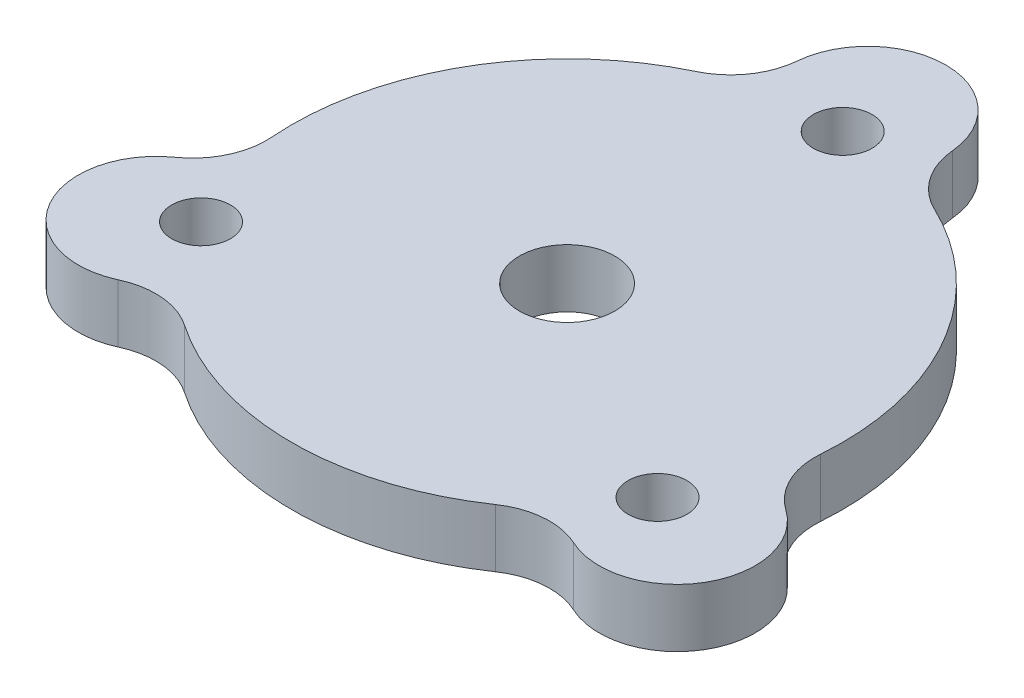
ISO-10303-21;
HEADER;
FILE_DESCRIPTION(('STEP AP214'),'2;1');
FILE_NAME('part.step','',(''),(''),'','','');
FILE_SCHEMA(('AUTOMOTIVE_DESIGN { 1 0 10303 214 1 1 1 1 }'));
ENDSEC;
DATA;
#1=APPLICATION_CONTEXT('core data for automotive mechanical design processes');
#2=APPLICATION_PROTOCOL_DEFINITION('international standard','automotive_design',2000,#1);
#3=PRODUCT_CONTEXT('',#1,'mechanical');
#4=PRODUCT('Part','Part','',(#3));
#5=PRODUCT_RELATED_PRODUCT_CATEGORY('part','',(#4));
#6=PRODUCT_DEFINITION_FORMATION('','',#4);
#7=PRODUCT_DEFINITION_CONTEXT('part definition',#1,'design');
#8=PRODUCT_DEFINITION('design','',#6,#7);
#9=PRODUCT_DEFINITION_SHAPE('','',#8);
#10=(LENGTH_UNIT() NAMED_UNIT(*) SI_UNIT(.MILLI.,.METRE.));
#11=(NAMED_UNIT(*) PLANE_ANGLE_UNIT() SI_UNIT($,.RADIAN.));
#12=(NAMED_UNIT(*) SI_UNIT($,.STERADIAN.) SOLID_ANGLE_UNIT());
#13=UNCERTAINTY_MEASURE_WITH_UNIT(LENGTH_MEASURE(1.E-05),#10,'distance_accuracy_value','');
#14=(GEOMETRIC_REPRESENTATION_CONTEXT(3) GLOBAL_UNCERTAINTY_ASSIGNED_CONTEXT((#13)) GLOBAL_UNIT_ASSIGNED_CONTEXT((#10,
#11,#12)) REPRESENTATION_CONTEXT('',''));
#15=CARTESIAN_POINT('',(0.,0.,0.));
#16=DIRECTION('',(0.,0.,1.));
#17=DIRECTION('',(1.,0.,0.));
#18=AXIS2_PLACEMENT_3D('',#15,#16,#17);
#19=CARTESIAN_POINT('',(0.,3.175,-16.3853223808158));
#20=DIRECTION('',(0.,-1.,0.));
#21=DIRECTION('',(0.,0.,-1.));
#22=AXIS2_PLACEMENT_3D('',#19,#20,#21);
#23=PLANE('',#22);
#24=CARTESIAN_POINT('',(-12.8850275402406,3.175,7.05928360982367));
#25=DIRECTION('',(0.,1.,0.));
#26=DIRECTION('',(0.,0.,1.));
#27=AXIS2_PLACEMENT_3D('',#24,#25,#26);
#28=CIRCLE('',#27,1.5999999999992);
#29=CARTESIAN_POINT('',(-12.8850275402406,3.175,8.65928360982287));
#30=VERTEX_POINT('',#29);
#31=EDGE_CURVE('E423',#30,#30,#28,.T.);
#32=ORIENTED_EDGE('',*,*,#31,.F.);
#33=EDGE_LOOP('',(#32));
#34=FACE_BOUND('',#33,.T.);
#35=CARTESIAN_POINT('',(12.5560327087464,3.175,7.62911937339878));
#36=DIRECTION('',(0.,1.,0.));
#37=DIRECTION('',(0.,0.,1.));
#38=AXIS2_PLACEMENT_3D('',#35,#36,#37);
#39=CIRCLE('',#38,1.59999999999807);
#40=CARTESIAN_POINT('',(12.5560327087464,3.175,9.22911937339685));
#41=VERTEX_POINT('',#40);
#42=EDGE_CURVE('E428',#41,#41,#39,.T.);
#43=ORIENTED_EDGE('',*,*,#42,.F.);
#44=EDGE_LOOP('',(#43));
#45=FACE_BOUND('',#44,.T.);
#46=CARTESIAN_POINT('',(0.328994831493823,3.175,-14.688402983222));
#47=DIRECTION('',(0.,1.,0.));
#48=DIRECTION('',(0.,0.,1.));
#49=AXIS2_PLACEMENT_3D('',#46,#47,#48);
#50=CIRCLE('',#49,1.59999999999887);
#51=CARTESIAN_POINT('',(0.328994831493823,3.175,-13.0884029832231));
#52=VERTEX_POINT('',#51);
#53=EDGE_CURVE('E242',#52,#52,#50,.T.);
#54=ORIENTED_EDGE('',*,*,#53,.F.);
#55=EDGE_LOOP('',(#54));
#56=FACE_BOUND('',#55,.T.);
#57=CARTESIAN_POINT('',(0.,3.175,0.));
#58=DIRECTION('',(0.,1.,0.));
#59=DIRECTION('',(0.,0.,1.));
#60=AXIS2_PLACEMENT_3D('',#57,#58,#59);
#61=CIRCLE('',#60,15.);
#62=CARTESIAN_POINT('',(14.9562295029777,3.175,1.1450760037045));
#63=VERTEX_POINT('',#62);
#64=CARTESIAN_POINT('',(6.48644984301678,3.175,-13.5250126962612));
#65=VERTEX_POINT('',#64);
#66=EDGE_CURVE('E163',#63,#65,#61,.T.);
#67=ORIENTED_EDGE('',*,*,#66,.T.);
#68=CARTESIAN_POINT('',(8.21616980115459,3.175,-17.1316827485976));
#69=DIRECTION('',(0.,-1.,0.));
#70=DIRECTION('',(0.,0.,-1.));
#71=AXIS2_PLACEMENT_3D('',#68,#69,#70);
#72=CIRCLE('',#71,4.);
#73=CARTESIAN_POINT('',(4.23257232180691,3.175,-16.7698110551276));
#74=VERTEX_POINT('',#73);
#75=EDGE_CURVE('E194',#65,#74,#72,.T.);
#76=ORIENTED_EDGE('',*,*,#75,.T.);
#77=CARTESIAN_POINT('',(0.,3.175,-16.3853223808158));
#78=DIRECTION('',(0.,1.,0.));
#79=DIRECTION('',(0.,0.,-1.));
#80=AXIS2_PLACEMENT_3D('',#77,#78,#79);
#81=CIRCLE('',#80,4.25);
#82=CARTESIAN_POINT('',(-4.23257232180691,3.175,-16.7698110551276));
#83=VERTEX_POINT('',#82);
#84=EDGE_CURVE('E162',#74,#83,#81,.T.);
#85=ORIENTED_EDGE('',*,*,#84,.T.);
#86=CARTESIAN_POINT('',(-8.21616980115458,3.175,-17.1316827485976));
#87=DIRECTION('',(0.,-1.,0.));
#88=DIRECTION('',(0.,0.,-1.));
#89=AXIS2_PLACEMENT_3D('',#86,#87,#88);
#90=CIRCLE('',#89,4.);
#91=CARTESIAN_POINT('',(-6.48644984301678,3.175,-13.5250126962612));
#92=VERTEX_POINT('',#91);
#93=EDGE_CURVE('E190',#83,#92,#90,.T.);
#94=ORIENTED_EDGE('',*,*,#93,.T.);
#95=CARTESIAN_POINT('',(0.,3.175,0.));
#96=DIRECTION('',(0.,1.,0.));
#97=DIRECTION('',(0.,0.,1.));
#98=AXIS2_PLACEMENT_3D('',#95,#96,#97);
#99=CIRCLE('',#98,15.);
#100=CARTESIAN_POINT('',(-14.9562295029777,3.175,1.14507600370451));
#101=VERTEX_POINT('',#100);
#102=EDGE_CURVE('E223',#92,#101,#99,.T.);
#103=ORIENTED_EDGE('',*,*,#102,.T.);
#104=CARTESIAN_POINT('',(-18.9445573704384,3.175,1.45042960469238));
#105=DIRECTION('',(0.,-1.,0.));
#106=DIRECTION('',(0.,0.,-1.));
#107=AXIS2_PLACEMENT_3D('',#104,#105,#106);
#108=CIRCLE('',#107,4.);
#109=CARTESIAN_POINT('',(-16.6393685513091,3.175,4.71939037352415));
#110=VERTEX_POINT('',#109);
#111=EDGE_CURVE('E132',#101,#110,#108,.T.);
#112=ORIENTED_EDGE('',*,*,#111,.T.);
#113=CARTESIAN_POINT('',(-14.1901054309842,3.175,8.19266119040791));
#114=DIRECTION('',(0.,1.,0.));
#115=DIRECTION('',(0.,0.,-1.));
#116=AXIS2_PLACEMENT_3D('',#113,#114,#115);
#117=CIRCLE('',#116,4.25);
#118=CARTESIAN_POINT('',(-12.4067962295022,3.175,12.0504206816035));
#119=VERTEX_POINT('',#118);
#120=EDGE_CURVE('E140',#110,#119,#117,.T.);
#121=ORIENTED_EDGE('',*,*,#120,.T.);
#122=CARTESIAN_POINT('',(-10.7283875692838,3.175,15.6812531439052));
#123=DIRECTION('',(0.,-1.,0.));
#124=DIRECTION('',(0.,0.,-1.));
#125=AXIS2_PLACEMENT_3D('',#122,#123,#124);
#126=CIRCLE('',#125,4.);
#127=CARTESIAN_POINT('',(-8.4697796599609,3.175,12.3799366925567));
#128=VERTEX_POINT('',#127);
#129=EDGE_CURVE('E11',#119,#128,#126,.T.);
#130=ORIENTED_EDGE('',*,*,#129,.T.);
#131=CARTESIAN_POINT('',(0.,3.175,0.));
#132=DIRECTION('',(0.,1.,0.));
#133=DIRECTION('',(0.,0.,1.));
#134=AXIS2_PLACEMENT_3D('',#131,#132,#133);
#135=CIRCLE('',#134,15.);
#136=CARTESIAN_POINT('',(8.46977965996091,3.175,12.3799366925567));
#137=VERTEX_POINT('',#136);
#138=EDGE_CURVE('E210',#128,#137,#135,.T.);
#139=ORIENTED_EDGE('',*,*,#138,.T.);
#140=CARTESIAN_POINT('',(10.7283875692838,3.175,15.6812531439052));
#141=DIRECTION('',(0.,-1.,0.));
#142=DIRECTION('',(0.,0.,-1.));
#143=AXIS2_PLACEMENT_3D('',#140,#141,#142);
#144=CIRCLE('',#143,4.);
#145=CARTESIAN_POINT('',(12.4067962295022,3.175,12.0504206816035));
#146=VERTEX_POINT('',#145);
#147=EDGE_CURVE('E202',#137,#146,#144,.T.);
#148=ORIENTED_EDGE('',*,*,#147,.T.);
#149=CARTESIAN_POINT('',(14.1901054309842,3.175,8.1926611904079));
#150=DIRECTION('',(0.,1.,0.));
#151=DIRECTION('',(0.,0.,-1.));
#152=AXIS2_PLACEMENT_3D('',#149,#150,#151);
#153=CIRCLE('',#152,4.25);
#154=CARTESIAN_POINT('',(16.6393685513091,3.175,4.71939037352414));
#155=VERTEX_POINT('',#154);
#156=EDGE_CURVE('E208',#146,#155,#153,.T.);
#157=ORIENTED_EDGE('',*,*,#156,.T.);
#158=CARTESIAN_POINT('',(18.9445573704384,3.175,1.45042960469237));
#159=DIRECTION('',(0.,-1.,0.));
#160=DIRECTION('',(0.,0.,-1.));
#161=AXIS2_PLACEMENT_3D('',#158,#159,#160);
#162=CIRCLE('',#161,4.);
#163=EDGE_CURVE('E198',#155,#63,#162,.T.);
#164=ORIENTED_EDGE('',*,*,#163,.T.);
#165=EDGE_LOOP('',(#67,#76,#85,#94,#103,#112,#121,#130,#139,#148,#157,#164));
#166=FACE_BOUND('',#165,.T.);
#167=CARTESIAN_POINT('',(0.,3.175,0.));
#168=DIRECTION('',(0.,1.,0.));
#169=DIRECTION('',(0.,0.,1.));
#170=AXIS2_PLACEMENT_3D('',#167,#168,#169);
#171=CIRCLE('',#170,2.6);
#172=CARTESIAN_POINT('',(0.,3.175,2.6));
#173=VERTEX_POINT('',#172);
#174=EDGE_CURVE('E230',#173,#173,#171,.T.);
#175=ORIENTED_EDGE('',*,*,#174,.F.);
#176=EDGE_LOOP('',(#175));
#177=FACE_BOUND('',#176,.T.);
#178=ADVANCED_FACE('F33',(#34,#45,#56,#166,#177),#23,.F.);
#179=CARTESIAN_POINT('',(0.,0.,-16.3853223808158));
#180=DIRECTION('',(0.,-1.,0.));
#181=DIRECTION('',(0.,0.,-1.));
#182=AXIS2_PLACEMENT_3D('',#179,#180,#181);
#183=PLANE('',#182);
#184=CARTESIAN_POINT('',(-12.8850275402406,0.,7.05928360982367));
#185=DIRECTION('',(0.,1.,0.));
#186=DIRECTION('',(0.,0.,1.));
#187=AXIS2_PLACEMENT_3D('',#184,#185,#186);
#188=CIRCLE('',#187,1.5999999999992);
#189=CARTESIAN_POINT('',(-12.8850275402406,0.,8.65928360982287));
#190=VERTEX_POINT('',#189);
#191=EDGE_CURVE('E239',#190,#190,#188,.T.);
#192=ORIENTED_EDGE('',*,*,#191,.T.);
#193=EDGE_LOOP('',(#192));
#194=FACE_BOUND('',#193,.T.);
#195=CARTESIAN_POINT('',(12.5560327087464,0.,7.62911937339878));
#196=DIRECTION('',(0.,1.,0.));
#197=DIRECTION('',(0.,0.,1.));
#198=AXIS2_PLACEMENT_3D('',#195,#196,#197);
#199=CIRCLE('',#198,1.59999999999807);
#200=CARTESIAN_POINT('',(12.5560327087464,0.,9.22911937339685));
#201=VERTEX_POINT('',#200);
#202=EDGE_CURVE('E424',#201,#201,#199,.T.);
#203=ORIENTED_EDGE('',*,*,#202,.T.);
#204=EDGE_LOOP('',(#203));
#205=FACE_BOUND('',#204,.T.);
#206=CARTESIAN_POINT('',(0.328994831493823,0.,-14.688402983222));
#207=DIRECTION('',(0.,1.,0.));
#208=DIRECTION('',(0.,0.,1.));
#209=AXIS2_PLACEMENT_3D('',#206,#207,#208);
#210=CIRCLE('',#209,1.59999999999887);
#211=CARTESIAN_POINT('',(0.328994831493823,0.,-13.0884029832231));
#212=VERTEX_POINT('',#211);
#213=EDGE_CURVE('E432',#212,#212,#210,.T.);
#214=ORIENTED_EDGE('',*,*,#213,.T.);
#215=EDGE_LOOP('',(#214));
#216=FACE_BOUND('',#215,.T.);
#217=CARTESIAN_POINT('',(0.,0.,-16.3853223808158));
#218=DIRECTION('',(0.,1.,0.));
#219=DIRECTION('',(0.,0.,-1.));
#220=AXIS2_PLACEMENT_3D('',#217,#218,#219);
#221=CIRCLE('',#220,4.25);
#222=CARTESIAN_POINT('',(4.23257232180691,0.,-16.7698110551276));
#223=VERTEX_POINT('',#222);
#224=CARTESIAN_POINT('',(-4.23257232180691,0.,-16.7698110551276));
#225=VERTEX_POINT('',#224);
#226=EDGE_CURVE('E153',#223,#225,#221,.T.);
#227=ORIENTED_EDGE('',*,*,#226,.F.);
#228=CARTESIAN_POINT('',(8.21616980115459,0.,-17.1316827485976));
#229=DIRECTION('',(0.,-1.,0.));
#230=DIRECTION('',(0.,0.,-1.));
#231=AXIS2_PLACEMENT_3D('',#228,#229,#230);
#232=CIRCLE('',#231,4.);
#233=CARTESIAN_POINT('',(6.48644984301678,0.,-13.5250126962612));
#234=VERTEX_POINT('',#233);
#235=EDGE_CURVE('E192',#223,#234,#232,.F.);
#236=ORIENTED_EDGE('',*,*,#235,.T.);
#237=CARTESIAN_POINT('',(0.,0.,0.));
#238=DIRECTION('',(0.,1.,0.));
#239=DIRECTION('',(0.,0.,1.));
#240=AXIS2_PLACEMENT_3D('',#237,#238,#239);
#241=CIRCLE('',#240,15.);
#242=CARTESIAN_POINT('',(14.9562295029777,0.,1.1450760037045));
#243=VERTEX_POINT('',#242);
#244=EDGE_CURVE('E159',#243,#234,#241,.T.);
#245=ORIENTED_EDGE('',*,*,#244,.F.);
#246=CARTESIAN_POINT('',(18.9445573704384,0.,1.45042960469237));
#247=DIRECTION('',(0.,-1.,0.));
#248=DIRECTION('',(0.,0.,-1.));
#249=AXIS2_PLACEMENT_3D('',#246,#247,#248);
#250=CIRCLE('',#249,4.);
#251=CARTESIAN_POINT('',(16.6393685513091,0.,4.71939037352414));
#252=VERTEX_POINT('',#251);
#253=EDGE_CURVE('E196',#243,#252,#250,.F.);
#254=ORIENTED_EDGE('',*,*,#253,.T.);
#255=CARTESIAN_POINT('',(14.1901054309842,0.,8.1926611904079));
#256=DIRECTION('',(0.,1.,0.));
#257=DIRECTION('',(0.,0.,-1.));
#258=AXIS2_PLACEMENT_3D('',#255,#256,#257);
#259=CIRCLE('',#258,4.25);
#260=CARTESIAN_POINT('',(12.4067962295022,0.,12.0504206816035));
#261=VERTEX_POINT('',#260);
#262=EDGE_CURVE('E151',#261,#252,#259,.T.);
#263=ORIENTED_EDGE('',*,*,#262,.F.);
#264=CARTESIAN_POINT('',(10.7283875692838,0.,15.6812531439052));
#265=DIRECTION('',(0.,-1.,0.));
#266=DIRECTION('',(0.,0.,-1.));
#267=AXIS2_PLACEMENT_3D('',#264,#265,#266);
#268=CIRCLE('',#267,4.);
#269=CARTESIAN_POINT('',(8.46977965996091,0.,12.3799366925567));
#270=VERTEX_POINT('',#269);
#271=EDGE_CURVE('E200',#261,#270,#268,.F.);
#272=ORIENTED_EDGE('',*,*,#271,.T.);
#273=CARTESIAN_POINT('',(0.,0.,0.));
#274=DIRECTION('',(0.,1.,0.));
#275=DIRECTION('',(0.,0.,1.));
#276=AXIS2_PLACEMENT_3D('',#273,#274,#275);
#277=CIRCLE('',#276,15.);
#278=CARTESIAN_POINT('',(-8.4697796599609,0.,12.3799366925567));
#279=VERTEX_POINT('',#278);
#280=EDGE_CURVE('E148',#279,#270,#277,.T.);
#281=ORIENTED_EDGE('',*,*,#280,.F.);
#282=CARTESIAN_POINT('',(-10.7283875692838,0.,15.6812531439052));
#283=DIRECTION('',(0.,-1.,0.));
#284=DIRECTION('',(0.,0.,-1.));
#285=AXIS2_PLACEMENT_3D('',#282,#283,#284);
#286=CIRCLE('',#285,4.);
#287=CARTESIAN_POINT('',(-12.4067962295022,0.,12.0504206816035));
#288=VERTEX_POINT('',#287);
#289=EDGE_CURVE('E41',#279,#288,#286,.F.);
#290=ORIENTED_EDGE('',*,*,#289,.T.);
#291=CARTESIAN_POINT('',(-14.1901054309842,0.,8.19266119040791));
#292=DIRECTION('',(0.,1.,0.));
#293=DIRECTION('',(0.,0.,-1.));
#294=AXIS2_PLACEMENT_3D('',#291,#292,#293);
#295=CIRCLE('',#294,4.25);
#296=CARTESIAN_POINT('',(-16.6393685513091,0.,4.71939037352415));
#297=VERTEX_POINT('',#296);
#298=EDGE_CURVE('E138',#297,#288,#295,.T.);
#299=ORIENTED_EDGE('',*,*,#298,.F.);
#300=CARTESIAN_POINT('',(-18.9445573704384,0.,1.45042960469238));
#301=DIRECTION('',(0.,-1.,0.));
#302=DIRECTION('',(0.,0.,-1.));
#303=AXIS2_PLACEMENT_3D('',#300,#301,#302);
#304=CIRCLE('',#303,4.);
#305=CARTESIAN_POINT('',(-14.9562295029777,0.,1.14507600370451));
#306=VERTEX_POINT('',#305);
#307=EDGE_CURVE('E122',#297,#306,#304,.F.);
#308=ORIENTED_EDGE('',*,*,#307,.T.);
#309=CARTESIAN_POINT('',(0.,0.,0.));
#310=DIRECTION('',(0.,1.,0.));
#311=DIRECTION('',(0.,0.,1.));
#312=AXIS2_PLACEMENT_3D('',#309,#310,#311);
#313=CIRCLE('',#312,15.);
#314=CARTESIAN_POINT('',(-6.48644984301678,0.,-13.5250126962612));
#315=VERTEX_POINT('',#314);
#316=EDGE_CURVE('E149',#315,#306,#313,.T.);
#317=ORIENTED_EDGE('',*,*,#316,.F.);
#318=CARTESIAN_POINT('',(-8.21616980115458,0.,-17.1316827485976));
#319=DIRECTION('',(0.,-1.,0.));
#320=DIRECTION('',(0.,0.,-1.));
#321=AXIS2_PLACEMENT_3D('',#318,#319,#320);
#322=CIRCLE('',#321,4.);
#323=EDGE_CURVE('E188',#315,#225,#322,.F.);
#324=ORIENTED_EDGE('',*,*,#323,.T.);
#325=EDGE_LOOP('',(#227,#236,#245,#254,#263,#272,#281,#290,#299,#308,#317,#324));
#326=FACE_BOUND('',#325,.T.);
#327=CARTESIAN_POINT('',(0.,0.,0.));
#328=DIRECTION('',(0.,1.,0.));
#329=DIRECTION('',(0.,0.,1.));
#330=AXIS2_PLACEMENT_3D('',#327,#328,#329);
#331=CIRCLE('',#330,2.6);
#332=CARTESIAN_POINT('',(0.,0.,2.6));
#333=VERTEX_POINT('',#332);
#334=EDGE_CURVE('E234',#333,#333,#331,.T.);
#335=ORIENTED_EDGE('',*,*,#334,.T.);
#336=EDGE_LOOP('',(#335));
#337=FACE_BOUND('',#336,.T.);
#338=ADVANCED_FACE('F145',(#194,#205,#216,#326,#337),#183,.T.);
#339=CARTESIAN_POINT('',(0.,3.175,-16.3853223808158));
#340=DIRECTION('',(0.,-1.,0.));
#341=DIRECTION('',(0.,0.,-1.));
#342=AXIS2_PLACEMENT_3D('',#339,#340,#341);
#343=CYLINDRICAL_SURFACE('',#342,4.25);
#344=ORIENTED_EDGE('',*,*,#226,.T.);
#345=DIRECTION('',(0.,-1.,0.));
#346=VECTOR('',#345,1.);
#347=CARTESIAN_POINT('',(-4.23257232180691,3.175,-16.7698110551276));
#348=LINE('',#347,#346);
#349=EDGE_CURVE('E171',#225,#83,#348,.F.);
#350=ORIENTED_EDGE('',*,*,#349,.T.);
#351=ORIENTED_EDGE('',*,*,#84,.F.);
#352=DIRECTION('',(0.,-1.,0.));
#353=VECTOR('',#352,1.);
#354=CARTESIAN_POINT('',(4.23257232180691,3.175,-16.7698110551276));
#355=LINE('',#354,#353);
#356=EDGE_CURVE('E168',#74,#223,#355,.T.);
#357=ORIENTED_EDGE('',*,*,#356,.T.);
#358=EDGE_LOOP('',(#344,#350,#351,#357));
#359=FACE_BOUND('',#358,.T.);
#360=ADVANCED_FACE('F263',(#359),#343,.T.);
#361=CARTESIAN_POINT('',(0.,3.175,0.));
#362=DIRECTION('',(0.,-1.,0.));
#363=DIRECTION('',(0.,0.,-1.));
#364=AXIS2_PLACEMENT_3D('',#361,#362,#363);
#365=CYLINDRICAL_SURFACE('',#364,15.);
#366=ORIENTED_EDGE('',*,*,#316,.T.);
#367=DIRECTION('',(0.,-1.,0.));
#368=VECTOR('',#367,1.);
#369=CARTESIAN_POINT('',(-14.9562295029777,3.175,1.14507600370451));
#370=LINE('',#369,#368);
#371=EDGE_CURVE('E127',#306,#101,#370,.F.);
#372=ORIENTED_EDGE('',*,*,#371,.T.);
#373=ORIENTED_EDGE('',*,*,#102,.F.);
#374=DIRECTION('',(0.,-1.,0.));
#375=VECTOR('',#374,1.);
#376=CARTESIAN_POINT('',(-6.48644984301678,3.175,-13.5250126962612));
#377=LINE('',#376,#375);
#378=EDGE_CURVE('E141',#92,#315,#377,.T.);
#379=ORIENTED_EDGE('',*,*,#378,.T.);
#380=EDGE_LOOP('',(#366,#372,#373,#379));
#381=FACE_BOUND('',#380,.T.);
#382=ADVANCED_FACE('F254',(#381),#365,.T.);
#383=CARTESIAN_POINT('',(-14.1901054309842,3.175,8.19266119040791));
#384=DIRECTION('',(0.,-1.,0.));
#385=DIRECTION('',(0.,0.,-1.));
#386=AXIS2_PLACEMENT_3D('',#383,#384,#385);
#387=CYLINDRICAL_SURFACE('',#386,4.25);
#388=ORIENTED_EDGE('',*,*,#120,.F.);
#389=DIRECTION('',(0.,-1.,0.));
#390=VECTOR('',#389,1.);
#391=CARTESIAN_POINT('',(-16.6393685513091,3.175,4.71939037352415));
#392=LINE('',#391,#390);
#393=EDGE_CURVE('E126',#110,#297,#392,.T.);
#394=ORIENTED_EDGE('',*,*,#393,.T.);
#395=ORIENTED_EDGE('',*,*,#298,.T.);
#396=DIRECTION('',(0.,-1.,0.));
#397=VECTOR('',#396,1.);
#398=CARTESIAN_POINT('',(-12.4067962295022,3.175,12.0504206816035));
#399=LINE('',#398,#397);
#400=EDGE_CURVE('E142',#288,#119,#399,.F.);
#401=ORIENTED_EDGE('',*,*,#400,.T.);
#402=EDGE_LOOP('',(#388,#394,#395,#401));
#403=FACE_BOUND('',#402,.T.);
#404=ADVANCED_FACE('F137',(#403),#387,.T.);
#405=CARTESIAN_POINT('',(0.,3.175,0.));
#406=DIRECTION('',(0.,-1.,0.));
#407=DIRECTION('',(0.,0.,-1.));
#408=AXIS2_PLACEMENT_3D('',#405,#406,#407);
#409=CYLINDRICAL_SURFACE('',#408,15.);
#410=ORIENTED_EDGE('',*,*,#280,.T.);
#411=DIRECTION('',(0.,-1.,0.));
#412=VECTOR('',#411,1.);
#413=CARTESIAN_POINT('',(8.46977965996091,3.175,12.3799366925567));
#414=LINE('',#413,#412);
#415=EDGE_CURVE('E48',#270,#137,#414,.F.);
#416=ORIENTED_EDGE('',*,*,#415,.T.);
#417=ORIENTED_EDGE('',*,*,#138,.F.);
#418=DIRECTION('',(0.,-1.,0.));
#419=VECTOR('',#418,1.);
#420=CARTESIAN_POINT('',(-8.4697796599609,3.175,12.3799366925567));
#421=LINE('',#420,#419);
#422=EDGE_CURVE('E183',#128,#279,#421,.T.);
#423=ORIENTED_EDGE('',*,*,#422,.T.);
#424=EDGE_LOOP('',(#410,#416,#417,#423));
#425=FACE_BOUND('',#424,.T.);
#426=ADVANCED_FACE('F219',(#425),#409,.T.);
#427=CARTESIAN_POINT('',(14.1901054309842,3.175,8.1926611904079));
#428=DIRECTION('',(0.,-1.,0.));
#429=DIRECTION('',(0.,0.,-1.));
#430=AXIS2_PLACEMENT_3D('',#427,#428,#429);
#431=CYLINDRICAL_SURFACE('',#430,4.25);
#432=ORIENTED_EDGE('',*,*,#262,.T.);
#433=DIRECTION('',(0.,-1.,0.));
#434=VECTOR('',#433,1.);
#435=CARTESIAN_POINT('',(16.6393685513091,3.175,4.71939037352414));
#436=LINE('',#435,#434);
#437=EDGE_CURVE('E181',#252,#155,#436,.F.);
#438=ORIENTED_EDGE('',*,*,#437,.T.);
#439=ORIENTED_EDGE('',*,*,#156,.F.);
#440=DIRECTION('',(0.,-1.,0.));
#441=VECTOR('',#440,1.);
#442=CARTESIAN_POINT('',(12.4067962295022,3.175,12.0504206816035));
#443=LINE('',#442,#441);
#444=EDGE_CURVE('E178',#146,#261,#443,.T.);
#445=ORIENTED_EDGE('',*,*,#444,.T.);
#446=EDGE_LOOP('',(#432,#438,#439,#445));
#447=FACE_BOUND('',#446,.T.);
#448=ADVANCED_FACE('F214',(#447),#431,.T.);
#449=CARTESIAN_POINT('',(0.,3.175,0.));
#450=DIRECTION('',(0.,-1.,0.));
#451=DIRECTION('',(0.,0.,-1.));
#452=AXIS2_PLACEMENT_3D('',#449,#450,#451);
#453=CYLINDRICAL_SURFACE('',#452,15.);
#454=ORIENTED_EDGE('',*,*,#244,.T.);
#455=DIRECTION('',(0.,-1.,0.));
#456=VECTOR('',#455,1.);
#457=CARTESIAN_POINT('',(6.48644984301678,3.175,-13.5250126962612));
#458=LINE('',#457,#456);
#459=EDGE_CURVE('E176',#234,#65,#458,.F.);
#460=ORIENTED_EDGE('',*,*,#459,.T.);
#461=ORIENTED_EDGE('',*,*,#66,.F.);
#462=DIRECTION('',(0.,-1.,0.));
#463=VECTOR('',#462,1.);
#464=CARTESIAN_POINT('',(14.9562295029777,3.175,1.1450760037045));
#465=LINE('',#464,#463);
#466=EDGE_CURVE('E173',#63,#243,#465,.T.);
#467=ORIENTED_EDGE('',*,*,#466,.T.);
#468=EDGE_LOOP('',(#454,#460,#461,#467));
#469=FACE_BOUND('',#468,.T.);
#470=ADVANCED_FACE('F259',(#469),#453,.T.);
#471=CARTESIAN_POINT('',(0.,3.175,0.));
#472=DIRECTION('',(0.,-1.,0.));
#473=DIRECTION('',(0.,0.,-1.));
#474=AXIS2_PLACEMENT_3D('',#471,#472,#473);
#475=CYLINDRICAL_SURFACE('',#474,2.6);
#476=ORIENTED_EDGE('',*,*,#174,.T.);
#477=EDGE_LOOP('',(#476));
#478=FACE_BOUND('',#477,.T.);
#479=ORIENTED_EDGE('',*,*,#334,.F.);
#480=EDGE_LOOP('',(#479));
#481=FACE_BOUND('',#480,.T.);
#482=ADVANCED_FACE('F282',(#478,#481),#475,.F.);
#483=CARTESIAN_POINT('',(-18.9445573704384,3.175,1.45042960469238));
#484=DIRECTION('',(0.,1.,0.));
#485=DIRECTION('',(0.,0.,1.));
#486=AXIS2_PLACEMENT_3D('',#483,#484,#485);
#487=CYLINDRICAL_SURFACE('',#486,4.);
#488=ORIENTED_EDGE('',*,*,#111,.F.);
#489=ORIENTED_EDGE('',*,*,#371,.F.);
#490=ORIENTED_EDGE('',*,*,#307,.F.);
#491=ORIENTED_EDGE('',*,*,#393,.F.);
#492=EDGE_LOOP('',(#488,#489,#490,#491));
#493=FACE_BOUND('',#492,.T.);
#494=ADVANCED_FACE('F125',(#493),#487,.F.);
#495=CARTESIAN_POINT('',(-8.21616980115458,3.175,-17.1316827485976));
#496=DIRECTION('',(0.,1.,0.));
#497=DIRECTION('',(0.,0.,1.));
#498=AXIS2_PLACEMENT_3D('',#495,#496,#497);
#499=CYLINDRICAL_SURFACE('',#498,4.);
#500=ORIENTED_EDGE('',*,*,#93,.F.);
#501=ORIENTED_EDGE('',*,*,#349,.F.);
#502=ORIENTED_EDGE('',*,*,#323,.F.);
#503=ORIENTED_EDGE('',*,*,#378,.F.);
#504=EDGE_LOOP('',(#500,#501,#502,#503));
#505=FACE_BOUND('',#504,.T.);
#506=ADVANCED_FACE('F252',(#505),#499,.F.);
#507=CARTESIAN_POINT('',(8.21616980115459,3.175,-17.1316827485976));
#508=DIRECTION('',(0.,1.,0.));
#509=DIRECTION('',(0.,0.,1.));
#510=AXIS2_PLACEMENT_3D('',#507,#508,#509);
#511=CYLINDRICAL_SURFACE('',#510,4.);
#512=ORIENTED_EDGE('',*,*,#75,.F.);
#513=ORIENTED_EDGE('',*,*,#459,.F.);
#514=ORIENTED_EDGE('',*,*,#235,.F.);
#515=ORIENTED_EDGE('',*,*,#356,.F.);
#516=EDGE_LOOP('',(#512,#513,#514,#515));
#517=FACE_BOUND('',#516,.T.);
#518=ADVANCED_FACE('F262',(#517),#511,.F.);
#519=CARTESIAN_POINT('',(18.9445573704384,3.175,1.45042960469237));
#520=DIRECTION('',(0.,1.,0.));
#521=DIRECTION('',(0.,0.,1.));
#522=AXIS2_PLACEMENT_3D('',#519,#520,#521);
#523=CYLINDRICAL_SURFACE('',#522,4.);
#524=ORIENTED_EDGE('',*,*,#163,.F.);
#525=ORIENTED_EDGE('',*,*,#437,.F.);
#526=ORIENTED_EDGE('',*,*,#253,.F.);
#527=ORIENTED_EDGE('',*,*,#466,.F.);
#528=EDGE_LOOP('',(#524,#525,#526,#527));
#529=FACE_BOUND('',#528,.T.);
#530=ADVANCED_FACE('F330',(#529),#523,.F.);
#531=CARTESIAN_POINT('',(10.7283875692838,3.175,15.6812531439052));
#532=DIRECTION('',(0.,1.,0.));
#533=DIRECTION('',(0.,0.,1.));
#534=AXIS2_PLACEMENT_3D('',#531,#532,#533);
#535=CYLINDRICAL_SURFACE('',#534,4.);
#536=ORIENTED_EDGE('',*,*,#147,.F.);
#537=ORIENTED_EDGE('',*,*,#415,.F.);
#538=ORIENTED_EDGE('',*,*,#271,.F.);
#539=ORIENTED_EDGE('',*,*,#444,.F.);
#540=EDGE_LOOP('',(#536,#537,#538,#539));
#541=FACE_BOUND('',#540,.T.);
#542=ADVANCED_FACE('F218',(#541),#535,.F.);
#543=CARTESIAN_POINT('',(-10.7283875692838,3.175,15.6812531439052));
#544=DIRECTION('',(0.,1.,0.));
#545=DIRECTION('',(0.,0.,1.));
#546=AXIS2_PLACEMENT_3D('',#543,#544,#545);
#547=CYLINDRICAL_SURFACE('',#546,4.);
#548=ORIENTED_EDGE('',*,*,#129,.F.);
#549=ORIENTED_EDGE('',*,*,#400,.F.);
#550=ORIENTED_EDGE('',*,*,#289,.F.);
#551=ORIENTED_EDGE('',*,*,#422,.F.);
#552=EDGE_LOOP('',(#548,#549,#550,#551));
#553=FACE_BOUND('',#552,.T.);
#554=ADVANCED_FACE('F35',(#553),#547,.F.);
#555=CARTESIAN_POINT('',(0.328994831493823,0.,-14.688402983222));
#556=DIRECTION('',(0.,1.,0.));
#557=DIRECTION('',(0.,0.,1.));
#558=AXIS2_PLACEMENT_3D('',#555,#556,#557);
#559=CYLINDRICAL_SURFACE('',#558,1.59999999999887);
#560=ORIENTED_EDGE('',*,*,#213,.F.);
#561=EDGE_LOOP('',(#560));
#562=FACE_BOUND('',#561,.T.);
#563=ORIENTED_EDGE('',*,*,#53,.T.);
#564=EDGE_LOOP('',(#563));
#565=FACE_BOUND('',#564,.T.);
#566=ADVANCED_FACE('F349',(#562,#565),#559,.F.);
#567=CARTESIAN_POINT('',(12.5560327087464,0.,7.62911937339878));
#568=DIRECTION('',(0.,1.,0.));
#569=DIRECTION('',(0.,0.,1.));
#570=AXIS2_PLACEMENT_3D('',#567,#568,#569);
#571=CYLINDRICAL_SURFACE('',#570,1.59999999999807);
#572=ORIENTED_EDGE('',*,*,#202,.F.);
#573=EDGE_LOOP('',(#572));
#574=FACE_BOUND('',#573,.T.);
#575=ORIENTED_EDGE('',*,*,#42,.T.);
#576=EDGE_LOOP('',(#575));
#577=FACE_BOUND('',#576,.T.);
#578=ADVANCED_FACE('F355',(#574,#577),#571,.F.);
#579=CARTESIAN_POINT('',(-12.8850275402406,0.,7.05928360982367));
#580=DIRECTION('',(0.,1.,0.));
#581=DIRECTION('',(0.,0.,1.));
#582=AXIS2_PLACEMENT_3D('',#579,#580,#581);
#583=CYLINDRICAL_SURFACE('',#582,1.5999999999992);
#584=ORIENTED_EDGE('',*,*,#191,.F.);
#585=EDGE_LOOP('',(#584));
#586=FACE_BOUND('',#585,.T.);
#587=ORIENTED_EDGE('',*,*,#31,.T.);
#588=EDGE_LOOP('',(#587));
#589=FACE_BOUND('',#588,.T.);
#590=ADVANCED_FACE('F363',(#586,#589),#583,.F.);
#591=CLOSED_SHELL('',(#178,#338,#360,#382,#404,#426,#448,#470,#482,#494,#506,#518,#530,#542,
#554,#566,#578,#590));
#592=MANIFOLD_SOLID_BREP('B2',#591);
#593=ADVANCED_BREP_SHAPE_REPRESENTATION('',(#18,#592),#14);
#594=SHAPE_DEFINITION_REPRESENTATION(#9,#593);
ENDSEC;
END-ISO-10303-21;
